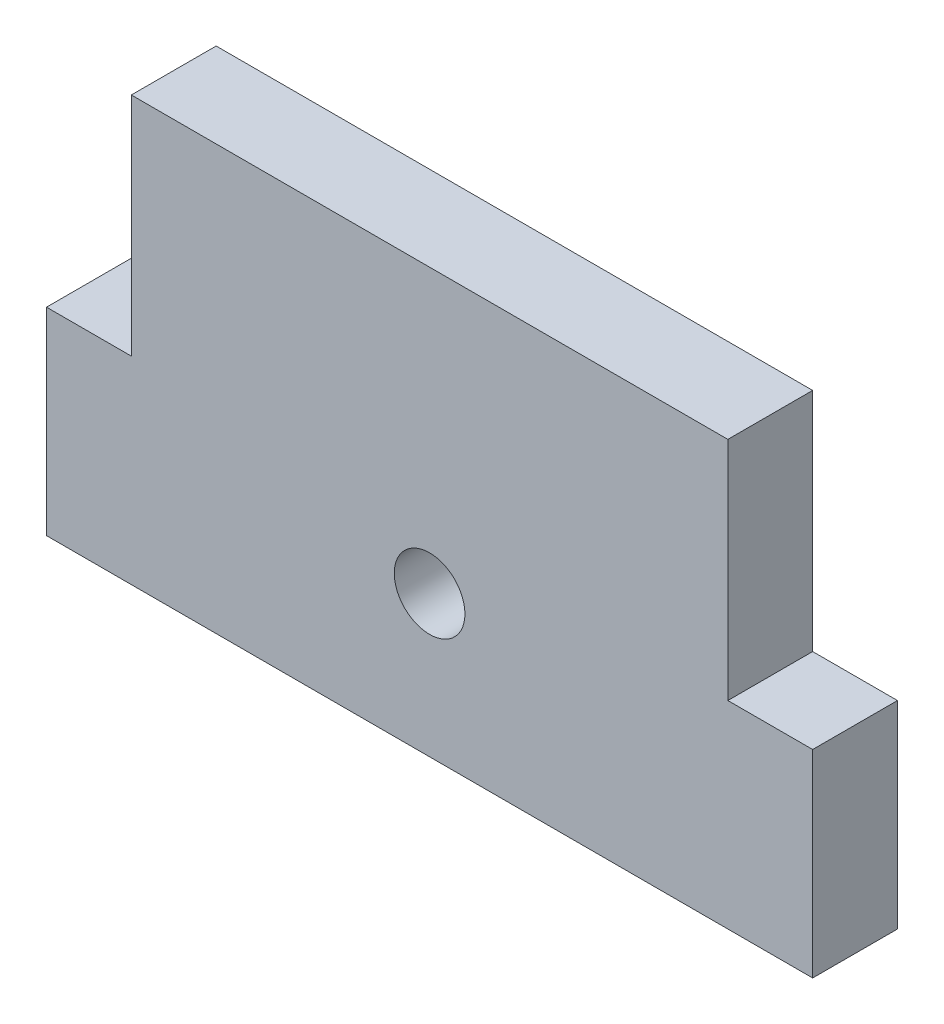
ISO-10303-21;
HEADER;
FILE_DESCRIPTION(('STEP AP214'),'2;1');
FILE_NAME('part.step','',(''),(''),'','','');
FILE_SCHEMA(('AUTOMOTIVE_DESIGN { 1 0 10303 214 1 1 1 1 }'));
ENDSEC;
DATA;
#1=APPLICATION_CONTEXT('core data for automotive mechanical design processes');
#2=APPLICATION_PROTOCOL_DEFINITION('international standard','automotive_design',2000,#1);
#3=PRODUCT_CONTEXT('',#1,'mechanical');
#4=PRODUCT('Part','Part','',(#3));
#5=PRODUCT_RELATED_PRODUCT_CATEGORY('part','',(#4));
#6=PRODUCT_DEFINITION_FORMATION('','',#4);
#7=PRODUCT_DEFINITION_CONTEXT('part definition',#1,'design');
#8=PRODUCT_DEFINITION('design','',#6,#7);
#9=PRODUCT_DEFINITION_SHAPE('','',#8);
#10=(LENGTH_UNIT() NAMED_UNIT(*) SI_UNIT(.MILLI.,.METRE.));
#11=(NAMED_UNIT(*) PLANE_ANGLE_UNIT() SI_UNIT($,.RADIAN.));
#12=(NAMED_UNIT(*) SI_UNIT($,.STERADIAN.) SOLID_ANGLE_UNIT());
#13=UNCERTAINTY_MEASURE_WITH_UNIT(LENGTH_MEASURE(1.E-05),#10,'distance_accuracy_value','');
#14=(GEOMETRIC_REPRESENTATION_CONTEXT(3) GLOBAL_UNCERTAINTY_ASSIGNED_CONTEXT((#13)) GLOBAL_UNIT_ASSIGNED_CONTEXT((#10,
#11,#12)) REPRESENTATION_CONTEXT('',''));
#15=CARTESIAN_POINT('',(0.,0.,0.));
#16=DIRECTION('',(0.,0.,1.));
#17=DIRECTION('',(1.,0.,0.));
#18=AXIS2_PLACEMENT_3D('',#15,#16,#17);
#19=CARTESIAN_POINT('',(0.,0.,6.));
#20=DIRECTION('',(0.,0.,1.));
#21=DIRECTION('',(1.,0.,0.));
#22=AXIS2_PLACEMENT_3D('',#19,#20,#21);
#23=PLANE('',#22);
#24=DIRECTION('',(0.,1.,0.));
#25=VECTOR('',#24,1.);
#26=CARTESIAN_POINT('',(54.2,14.,6.));
#27=LINE('',#26,#25);
#28=CARTESIAN_POINT('',(54.2,0.,6.));
#29=VERTEX_POINT('',#28);
#30=CARTESIAN_POINT('',(54.2,14.,6.));
#31=VERTEX_POINT('',#30);
#32=EDGE_CURVE('E145',#29,#31,#27,.T.);
#33=ORIENTED_EDGE('',*,*,#32,.T.);
#34=DIRECTION('',(-1.,0.,0.));
#35=VECTOR('',#34,1.);
#36=CARTESIAN_POINT('',(54.2,14.,6.));
#37=LINE('',#36,#35);
#38=CARTESIAN_POINT('',(48.2,14.,6.));
#39=VERTEX_POINT('',#38);
#40=EDGE_CURVE('E93',#31,#39,#37,.T.);
#41=ORIENTED_EDGE('',*,*,#40,.T.);
#42=DIRECTION('',(0.,1.,0.));
#43=VECTOR('',#42,1.);
#44=CARTESIAN_POINT('',(48.2,30.,6.));
#45=LINE('',#44,#43);
#46=CARTESIAN_POINT('',(48.2,30.,6.));
#47=VERTEX_POINT('',#46);
#48=EDGE_CURVE('E160',#39,#47,#45,.T.);
#49=ORIENTED_EDGE('',*,*,#48,.T.);
#50=DIRECTION('',(-1.,0.,0.));
#51=VECTOR('',#50,1.);
#52=CARTESIAN_POINT('',(6.,30.,6.));
#53=LINE('',#52,#51);
#54=CARTESIAN_POINT('',(6.,30.,6.));
#55=VERTEX_POINT('',#54);
#56=EDGE_CURVE('E173',#47,#55,#53,.T.);
#57=ORIENTED_EDGE('',*,*,#56,.T.);
#58=DIRECTION('',(0.,-1.,0.));
#59=VECTOR('',#58,1.);
#60=CARTESIAN_POINT('',(6.,30.,6.));
#61=LINE('',#60,#59);
#62=CARTESIAN_POINT('',(6.,14.,6.));
#63=VERTEX_POINT('',#62);
#64=EDGE_CURVE('E112',#55,#63,#61,.T.);
#65=ORIENTED_EDGE('',*,*,#64,.T.);
#66=DIRECTION('',(-1.,0.,0.));
#67=VECTOR('',#66,1.);
#68=CARTESIAN_POINT('',(0.,14.,6.));
#69=LINE('',#68,#67);
#70=CARTESIAN_POINT('',(0.,14.,6.));
#71=VERTEX_POINT('',#70);
#72=EDGE_CURVE('E106',#63,#71,#69,.T.);
#73=ORIENTED_EDGE('',*,*,#72,.T.);
#74=DIRECTION('',(0.,-1.,0.));
#75=VECTOR('',#74,1.);
#76=CARTESIAN_POINT('',(0.,14.,6.));
#77=LINE('',#76,#75);
#78=CARTESIAN_POINT('',(0.,0.,6.));
#79=VERTEX_POINT('',#78);
#80=EDGE_CURVE('E110',#71,#79,#77,.T.);
#81=ORIENTED_EDGE('',*,*,#80,.T.);
#82=DIRECTION('',(1.,0.,0.));
#83=VECTOR('',#82,1.);
#84=CARTESIAN_POINT('',(0.,0.,6.));
#85=LINE('',#84,#83);
#86=EDGE_CURVE('E50',#79,#29,#85,.T.);
#87=ORIENTED_EDGE('',*,*,#86,.T.);
#88=EDGE_LOOP('',(#33,#41,#49,#57,#65,#73,#81,#87));
#89=FACE_BOUND('',#88,.T.);
#90=CARTESIAN_POINT('',(27.1,10.,6.));
#91=DIRECTION('',(0.,0.,1.));
#92=DIRECTION('',(1.,0.,0.));
#93=AXIS2_PLACEMENT_3D('',#90,#91,#92);
#94=CIRCLE('',#93,2.5);
#95=CARTESIAN_POINT('',(29.6,10.,6.));
#96=VERTEX_POINT('',#95);
#97=EDGE_CURVE('E134',#96,#96,#94,.T.);
#98=ORIENTED_EDGE('',*,*,#97,.F.);
#99=EDGE_LOOP('',(#98));
#100=FACE_BOUND('',#99,.T.);
#101=ADVANCED_FACE('F33',(#89,#100),#23,.T.);
#102=CARTESIAN_POINT('',(0.,0.,0.));
#103=DIRECTION('',(0.,0.,1.));
#104=DIRECTION('',(1.,0.,0.));
#105=AXIS2_PLACEMENT_3D('',#102,#103,#104);
#106=PLANE('',#105);
#107=DIRECTION('',(0.,1.,0.));
#108=VECTOR('',#107,1.);
#109=CARTESIAN_POINT('',(54.2,14.,0.));
#110=LINE('',#109,#108);
#111=CARTESIAN_POINT('',(54.2,0.,0.));
#112=VERTEX_POINT('',#111);
#113=CARTESIAN_POINT('',(54.2,14.,0.));
#114=VERTEX_POINT('',#113);
#115=EDGE_CURVE('E130',#112,#114,#110,.T.);
#116=ORIENTED_EDGE('',*,*,#115,.F.);
#117=DIRECTION('',(1.,0.,0.));
#118=VECTOR('',#117,1.);
#119=CARTESIAN_POINT('',(0.,0.,0.));
#120=LINE('',#119,#118);
#121=CARTESIAN_POINT('',(0.,0.,0.));
#122=VERTEX_POINT('',#121);
#123=EDGE_CURVE('E85',#122,#112,#120,.T.);
#124=ORIENTED_EDGE('',*,*,#123,.F.);
#125=DIRECTION('',(0.,-1.,0.));
#126=VECTOR('',#125,1.);
#127=CARTESIAN_POINT('',(0.,14.,0.));
#128=LINE('',#127,#126);
#129=CARTESIAN_POINT('',(0.,14.,0.));
#130=VERTEX_POINT('',#129);
#131=EDGE_CURVE('E79',#130,#122,#128,.T.);
#132=ORIENTED_EDGE('',*,*,#131,.F.);
#133=DIRECTION('',(-1.,0.,0.));
#134=VECTOR('',#133,1.);
#135=CARTESIAN_POINT('',(0.,14.,0.));
#136=LINE('',#135,#134);
#137=CARTESIAN_POINT('',(6.,14.,0.));
#138=VERTEX_POINT('',#137);
#139=EDGE_CURVE('E120',#138,#130,#136,.T.);
#140=ORIENTED_EDGE('',*,*,#139,.F.);
#141=DIRECTION('',(0.,-1.,0.));
#142=VECTOR('',#141,1.);
#143=CARTESIAN_POINT('',(6.,30.,0.));
#144=LINE('',#143,#142);
#145=CARTESIAN_POINT('',(6.,30.,0.));
#146=VERTEX_POINT('',#145);
#147=EDGE_CURVE('E140',#146,#138,#144,.T.);
#148=ORIENTED_EDGE('',*,*,#147,.F.);
#149=DIRECTION('',(-1.,0.,0.));
#150=VECTOR('',#149,1.);
#151=CARTESIAN_POINT('',(6.,30.,0.));
#152=LINE('',#151,#150);
#153=CARTESIAN_POINT('',(48.2,30.,0.));
#154=VERTEX_POINT('',#153);
#155=EDGE_CURVE('E138',#154,#146,#152,.T.);
#156=ORIENTED_EDGE('',*,*,#155,.F.);
#157=DIRECTION('',(0.,1.,0.));
#158=VECTOR('',#157,1.);
#159=CARTESIAN_POINT('',(48.2,30.,0.));
#160=LINE('',#159,#158);
#161=CARTESIAN_POINT('',(48.2,14.,0.));
#162=VERTEX_POINT('',#161);
#163=EDGE_CURVE('E136',#162,#154,#160,.T.);
#164=ORIENTED_EDGE('',*,*,#163,.F.);
#165=DIRECTION('',(-1.,0.,0.));
#166=VECTOR('',#165,1.);
#167=CARTESIAN_POINT('',(54.2,14.,0.));
#168=LINE('',#167,#166);
#169=EDGE_CURVE('E133',#114,#162,#168,.T.);
#170=ORIENTED_EDGE('',*,*,#169,.F.);
#171=EDGE_LOOP('',(#116,#124,#132,#140,#148,#156,#164,#170));
#172=FACE_BOUND('',#171,.T.);
#173=CARTESIAN_POINT('',(27.1,10.,0.));
#174=DIRECTION('',(0.,0.,1.));
#175=DIRECTION('',(1.,0.,0.));
#176=AXIS2_PLACEMENT_3D('',#173,#174,#175);
#177=CIRCLE('',#176,2.5);
#178=CARTESIAN_POINT('',(29.6,10.,0.));
#179=VERTEX_POINT('',#178);
#180=EDGE_CURVE('E179',#179,#179,#177,.T.);
#181=ORIENTED_EDGE('',*,*,#180,.T.);
#182=EDGE_LOOP('',(#181));
#183=FACE_BOUND('',#182,.T.);
#184=ADVANCED_FACE('F164',(#172,#183),#106,.F.);
#185=CARTESIAN_POINT('',(54.2,14.,6.));
#186=DIRECTION('',(-1.,0.,0.));
#187=DIRECTION('',(0.,0.,1.));
#188=AXIS2_PLACEMENT_3D('',#185,#186,#187);
#189=PLANE('',#188);
#190=ORIENTED_EDGE('',*,*,#115,.T.);
#191=DIRECTION('',(0.,0.,-1.));
#192=VECTOR('',#191,1.);
#193=CARTESIAN_POINT('',(54.2,14.,6.));
#194=LINE('',#193,#192);
#195=EDGE_CURVE('E11',#31,#114,#194,.T.);
#196=ORIENTED_EDGE('',*,*,#195,.F.);
#197=ORIENTED_EDGE('',*,*,#32,.F.);
#198=DIRECTION('',(0.,0.,-1.));
#199=VECTOR('',#198,1.);
#200=CARTESIAN_POINT('',(54.2,0.,6.));
#201=LINE('',#200,#199);
#202=EDGE_CURVE('E126',#29,#112,#201,.T.);
#203=ORIENTED_EDGE('',*,*,#202,.T.);
#204=EDGE_LOOP('',(#190,#196,#197,#203));
#205=FACE_BOUND('',#204,.T.);
#206=ADVANCED_FACE('F35',(#205),#189,.F.);
#207=CARTESIAN_POINT('',(54.2,14.,6.));
#208=DIRECTION('',(0.,-1.,0.));
#209=DIRECTION('',(0.,0.,-1.));
#210=AXIS2_PLACEMENT_3D('',#207,#208,#209);
#211=PLANE('',#210);
#212=ORIENTED_EDGE('',*,*,#169,.T.);
#213=DIRECTION('',(0.,0.,-1.));
#214=VECTOR('',#213,1.);
#215=CARTESIAN_POINT('',(48.2,14.,6.));
#216=LINE('',#215,#214);
#217=EDGE_CURVE('E42',#39,#162,#216,.T.);
#218=ORIENTED_EDGE('',*,*,#217,.F.);
#219=ORIENTED_EDGE('',*,*,#40,.F.);
#220=ORIENTED_EDGE('',*,*,#195,.T.);
#221=EDGE_LOOP('',(#212,#218,#219,#220));
#222=FACE_BOUND('',#221,.T.);
#223=ADVANCED_FACE('F207',(#222),#211,.F.);
#224=CARTESIAN_POINT('',(48.2,30.,6.));
#225=DIRECTION('',(-1.,0.,0.));
#226=DIRECTION('',(0.,0.,1.));
#227=AXIS2_PLACEMENT_3D('',#224,#225,#226);
#228=PLANE('',#227);
#229=ORIENTED_EDGE('',*,*,#163,.T.);
#230=DIRECTION('',(0.,0.,-1.));
#231=VECTOR('',#230,1.);
#232=CARTESIAN_POINT('',(48.2,30.,6.));
#233=LINE('',#232,#231);
#234=EDGE_CURVE('E152',#47,#154,#233,.T.);
#235=ORIENTED_EDGE('',*,*,#234,.F.);
#236=ORIENTED_EDGE('',*,*,#48,.F.);
#237=ORIENTED_EDGE('',*,*,#217,.T.);
#238=EDGE_LOOP('',(#229,#235,#236,#237));
#239=FACE_BOUND('',#238,.T.);
#240=ADVANCED_FACE('F158',(#239),#228,.F.);
#241=CARTESIAN_POINT('',(6.,30.,6.));
#242=DIRECTION('',(0.,-1.,0.));
#243=DIRECTION('',(0.,0.,-1.));
#244=AXIS2_PLACEMENT_3D('',#241,#242,#243);
#245=PLANE('',#244);
#246=ORIENTED_EDGE('',*,*,#155,.T.);
#247=DIRECTION('',(0.,0.,-1.));
#248=VECTOR('',#247,1.);
#249=CARTESIAN_POINT('',(6.,30.,6.));
#250=LINE('',#249,#248);
#251=EDGE_CURVE('E149',#55,#146,#250,.T.);
#252=ORIENTED_EDGE('',*,*,#251,.F.);
#253=ORIENTED_EDGE('',*,*,#56,.F.);
#254=ORIENTED_EDGE('',*,*,#234,.T.);
#255=EDGE_LOOP('',(#246,#252,#253,#254));
#256=FACE_BOUND('',#255,.T.);
#257=ADVANCED_FACE('F169',(#256),#245,.F.);
#258=CARTESIAN_POINT('',(6.,30.,6.));
#259=DIRECTION('',(1.,0.,0.));
#260=DIRECTION('',(0.,1.,0.));
#261=AXIS2_PLACEMENT_3D('',#258,#259,#260);
#262=PLANE('',#261);
#263=ORIENTED_EDGE('',*,*,#147,.T.);
#264=DIRECTION('',(0.,0.,-1.));
#265=VECTOR('',#264,1.);
#266=CARTESIAN_POINT('',(6.,14.,6.));
#267=LINE('',#266,#265);
#268=EDGE_CURVE('E121',#63,#138,#267,.T.);
#269=ORIENTED_EDGE('',*,*,#268,.F.);
#270=ORIENTED_EDGE('',*,*,#64,.F.);
#271=ORIENTED_EDGE('',*,*,#251,.T.);
#272=EDGE_LOOP('',(#263,#269,#270,#271));
#273=FACE_BOUND('',#272,.T.);
#274=ADVANCED_FACE('F172',(#273),#262,.F.);
#275=CARTESIAN_POINT('',(0.,14.,6.));
#276=DIRECTION('',(0.,-1.,0.));
#277=DIRECTION('',(0.,0.,-1.));
#278=AXIS2_PLACEMENT_3D('',#275,#276,#277);
#279=PLANE('',#278);
#280=ORIENTED_EDGE('',*,*,#139,.T.);
#281=DIRECTION('',(0.,0.,-1.));
#282=VECTOR('',#281,1.);
#283=CARTESIAN_POINT('',(0.,14.,6.));
#284=LINE('',#283,#282);
#285=EDGE_CURVE('E117',#71,#130,#284,.T.);
#286=ORIENTED_EDGE('',*,*,#285,.F.);
#287=ORIENTED_EDGE('',*,*,#72,.F.);
#288=ORIENTED_EDGE('',*,*,#268,.T.);
#289=EDGE_LOOP('',(#280,#286,#287,#288));
#290=FACE_BOUND('',#289,.T.);
#291=ADVANCED_FACE('F118',(#290),#279,.F.);
#292=CARTESIAN_POINT('',(0.,14.,6.));
#293=DIRECTION('',(1.,0.,0.));
#294=DIRECTION('',(0.,1.,0.));
#295=AXIS2_PLACEMENT_3D('',#292,#293,#294);
#296=PLANE('',#295);
#297=ORIENTED_EDGE('',*,*,#131,.T.);
#298=DIRECTION('',(0.,0.,-1.));
#299=VECTOR('',#298,1.);
#300=CARTESIAN_POINT('',(0.,0.,6.));
#301=LINE('',#300,#299);
#302=EDGE_CURVE('E122',#79,#122,#301,.T.);
#303=ORIENTED_EDGE('',*,*,#302,.F.);
#304=ORIENTED_EDGE('',*,*,#80,.F.);
#305=ORIENTED_EDGE('',*,*,#285,.T.);
#306=EDGE_LOOP('',(#297,#303,#304,#305));
#307=FACE_BOUND('',#306,.T.);
#308=ADVANCED_FACE('F124',(#307),#296,.F.);
#309=CARTESIAN_POINT('',(0.,0.,6.));
#310=DIRECTION('',(0.,1.,0.));
#311=DIRECTION('',(0.,0.,1.));
#312=AXIS2_PLACEMENT_3D('',#309,#310,#311);
#313=PLANE('',#312);
#314=ORIENTED_EDGE('',*,*,#123,.T.);
#315=ORIENTED_EDGE('',*,*,#202,.F.);
#316=ORIENTED_EDGE('',*,*,#86,.F.);
#317=ORIENTED_EDGE('',*,*,#302,.T.);
#318=EDGE_LOOP('',(#314,#315,#316,#317));
#319=FACE_BOUND('',#318,.T.);
#320=ADVANCED_FACE('F195',(#319),#313,.F.);
#321=CARTESIAN_POINT('',(27.1,10.,6.));
#322=DIRECTION('',(0.,0.,-1.));
#323=DIRECTION('',(-1.,0.,0.));
#324=AXIS2_PLACEMENT_3D('',#321,#322,#323);
#325=CYLINDRICAL_SURFACE('',#324,2.5);
#326=ORIENTED_EDGE('',*,*,#97,.T.);
#327=EDGE_LOOP('',(#326));
#328=FACE_BOUND('',#327,.T.);
#329=ORIENTED_EDGE('',*,*,#180,.F.);
#330=EDGE_LOOP('',(#329));
#331=FACE_BOUND('',#330,.T.);
#332=ADVANCED_FACE('F185',(#328,#331),#325,.F.);
#333=CLOSED_SHELL('',(#101,#184,#206,#223,#240,#257,#274,#291,#308,#320,#332));
#334=MANIFOLD_SOLID_BREP('B2',#333);
#335=ADVANCED_BREP_SHAPE_REPRESENTATION('',(#18,#334),#14);
#336=SHAPE_DEFINITION_REPRESENTATION(#9,#335);
ENDSEC;
END-ISO-10303-21;
